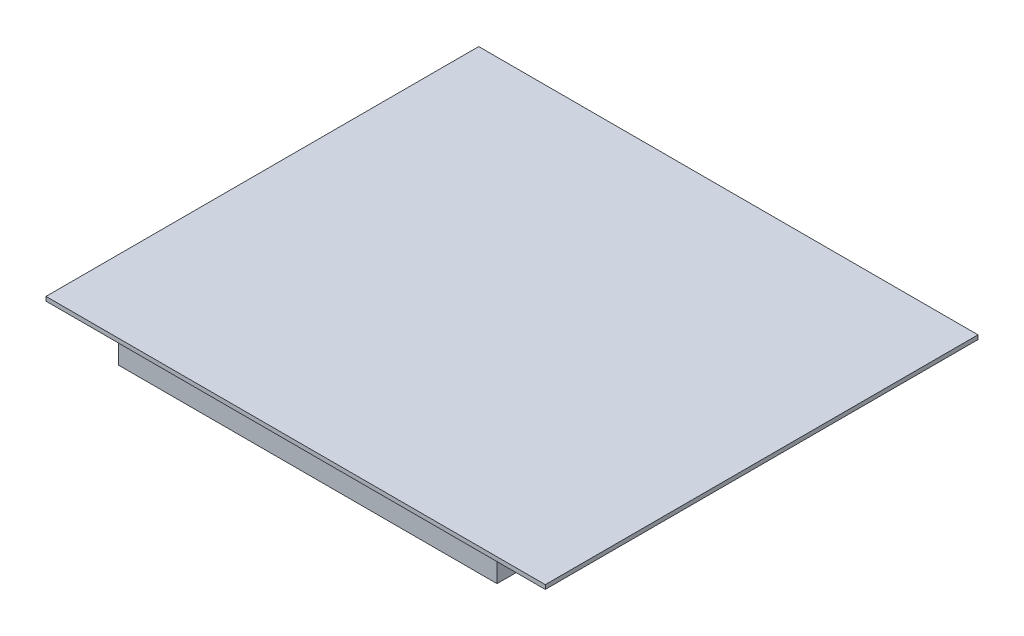
ISO-10303-21;
HEADER;
FILE_DESCRIPTION(('STEP AP214'),'2;1');
FILE_NAME('part.step','',(''),(''),'','','');
FILE_SCHEMA(('AUTOMOTIVE_DESIGN { 1 0 10303 214 1 1 1 1 }'));
ENDSEC;
DATA;
#1=APPLICATION_CONTEXT('core data for automotive mechanical design processes');
#2=APPLICATION_PROTOCOL_DEFINITION('international standard','automotive_design',2000,#1);
#3=PRODUCT_CONTEXT('',#1,'mechanical');
#4=PRODUCT('Part','Part','',(#3));
#5=PRODUCT_RELATED_PRODUCT_CATEGORY('part','',(#4));
#6=PRODUCT_DEFINITION_FORMATION('','',#4);
#7=PRODUCT_DEFINITION_CONTEXT('part definition',#1,'design');
#8=PRODUCT_DEFINITION('design','',#6,#7);
#9=PRODUCT_DEFINITION_SHAPE('','',#8);
#10=(LENGTH_UNIT() NAMED_UNIT(*) SI_UNIT(.MILLI.,.METRE.));
#11=(NAMED_UNIT(*) PLANE_ANGLE_UNIT() SI_UNIT($,.RADIAN.));
#12=(NAMED_UNIT(*) SI_UNIT($,.STERADIAN.) SOLID_ANGLE_UNIT());
#13=UNCERTAINTY_MEASURE_WITH_UNIT(LENGTH_MEASURE(1.E-05),#10,'distance_accuracy_value','');
#14=(GEOMETRIC_REPRESENTATION_CONTEXT(3) GLOBAL_UNCERTAINTY_ASSIGNED_CONTEXT((#13)) GLOBAL_UNIT_ASSIGNED_CONTEXT((#10,
#11,#12)) REPRESENTATION_CONTEXT('',''));
#15=CARTESIAN_POINT('',(0.,0.,0.));
#16=DIRECTION('',(0.,0.,1.));
#17=DIRECTION('',(1.,0.,0.));
#18=AXIS2_PLACEMENT_3D('',#15,#16,#17);
#19=CARTESIAN_POINT('',(0.,0.,0.));
#20=DIRECTION('',(0.,1.,0.));
#21=DIRECTION('',(0.,0.,1.));
#22=AXIS2_PLACEMENT_3D('',#19,#20,#21);
#23=PLANE('',#22);
#24=DIRECTION('',(0.,0.,1.));
#25=VECTOR('',#24,1.);
#26=CARTESIAN_POINT('',(-300.,0.,260.));
#27=LINE('',#26,#25);
#28=CARTESIAN_POINT('',(-300.,0.,-260.));
#29=VERTEX_POINT('',#28);
#30=CARTESIAN_POINT('',(-300.,0.,260.));
#31=VERTEX_POINT('',#30);
#32=EDGE_CURVE('E120',#29,#31,#27,.T.);
#33=ORIENTED_EDGE('',*,*,#32,.F.);
#34=DIRECTION('',(-1.,0.,0.));
#35=VECTOR('',#34,1.);
#36=CARTESIAN_POINT('',(300.,0.,-260.));
#37=LINE('',#36,#35);
#38=CARTESIAN_POINT('',(300.,0.,-260.));
#39=VERTEX_POINT('',#38);
#40=EDGE_CURVE('E133',#39,#29,#37,.T.);
#41=ORIENTED_EDGE('',*,*,#40,.F.);
#42=DIRECTION('',(0.,0.,-1.));
#43=VECTOR('',#42,1.);
#44=CARTESIAN_POINT('',(300.,0.,260.));
#45=LINE('',#44,#43);
#46=CARTESIAN_POINT('',(300.,0.,260.));
#47=VERTEX_POINT('',#46);
#48=EDGE_CURVE('E141',#47,#39,#45,.T.);
#49=ORIENTED_EDGE('',*,*,#48,.F.);
#50=DIRECTION('',(1.,0.,0.));
#51=VECTOR('',#50,1.);
#52=CARTESIAN_POINT('',(300.,0.,260.));
#53=LINE('',#52,#51);
#54=EDGE_CURVE('E123',#31,#47,#53,.T.);
#55=ORIENTED_EDGE('',*,*,#54,.F.);
#56=EDGE_LOOP('',(#33,#41,#49,#55));
#57=FACE_BOUND('',#56,.T.);
#58=DIRECTION('',(0.,0.,-1.));
#59=VECTOR('',#58,1.);
#60=CARTESIAN_POINT('',(-235.,0.,-248.));
#61=LINE('',#60,#59);
#62=CARTESIAN_POINT('',(-235.,0.,238.));
#63=VERTEX_POINT('',#62);
#64=CARTESIAN_POINT('',(-235.,0.,-248.));
#65=VERTEX_POINT('',#64);
#66=EDGE_CURVE('E50',#63,#65,#61,.T.);
#67=ORIENTED_EDGE('',*,*,#66,.F.);
#68=DIRECTION('',(-1.,0.,0.));
#69=VECTOR('',#68,1.);
#70=CARTESIAN_POINT('',(220.,0.,238.));
#71=LINE('',#70,#69);
#72=CARTESIAN_POINT('',(220.,0.,238.));
#73=VERTEX_POINT('',#72);
#74=EDGE_CURVE('E54',#73,#63,#71,.T.);
#75=ORIENTED_EDGE('',*,*,#74,.F.);
#76=DIRECTION('',(0.,0.,1.));
#77=VECTOR('',#76,1.);
#78=CARTESIAN_POINT('',(220.,0.,-248.));
#79=LINE('',#78,#77);
#80=CARTESIAN_POINT('',(220.,0.,-248.));
#81=VERTEX_POINT('',#80);
#82=EDGE_CURVE('E262',#81,#73,#79,.T.);
#83=ORIENTED_EDGE('',*,*,#82,.F.);
#84=DIRECTION('',(1.,0.,0.));
#85=VECTOR('',#84,1.);
#86=CARTESIAN_POINT('',(220.,0.,-248.));
#87=LINE('',#86,#85);
#88=EDGE_CURVE('E268',#65,#81,#87,.T.);
#89=ORIENTED_EDGE('',*,*,#88,.F.);
#90=EDGE_LOOP('',(#67,#75,#83,#89));
#91=FACE_BOUND('',#90,.T.);
#92=ADVANCED_FACE('F35',(#57,#91),#23,.F.);
#93=CARTESIAN_POINT('',(-300.,5.,260.));
#94=DIRECTION('',(1.,0.,0.));
#95=DIRECTION('',(0.,0.,-1.));
#96=AXIS2_PLACEMENT_3D('',#93,#94,#95);
#97=PLANE('',#96);
#98=ORIENTED_EDGE('',*,*,#32,.T.);
#99=DIRECTION('',(0.,-1.,0.));
#100=VECTOR('',#99,1.);
#101=CARTESIAN_POINT('',(-300.,5.,260.));
#102=LINE('',#101,#100);
#103=CARTESIAN_POINT('',(-300.,5.,260.));
#104=VERTEX_POINT('',#103);
#105=EDGE_CURVE('E11',#104,#31,#102,.T.);
#106=ORIENTED_EDGE('',*,*,#105,.F.);
#107=DIRECTION('',(0.,0.,1.));
#108=VECTOR('',#107,1.);
#109=CARTESIAN_POINT('',(-300.,5.,260.));
#110=LINE('',#109,#108);
#111=CARTESIAN_POINT('',(-300.,5.,-260.));
#112=VERTEX_POINT('',#111);
#113=EDGE_CURVE('E129',#112,#104,#110,.T.);
#114=ORIENTED_EDGE('',*,*,#113,.F.);
#115=DIRECTION('',(0.,-1.,0.));
#116=VECTOR('',#115,1.);
#117=CARTESIAN_POINT('',(-300.,5.,-260.));
#118=LINE('',#117,#116);
#119=EDGE_CURVE('E138',#112,#29,#118,.T.);
#120=ORIENTED_EDGE('',*,*,#119,.T.);
#121=EDGE_LOOP('',(#98,#106,#114,#120));
#122=FACE_BOUND('',#121,.T.);
#123=ADVANCED_FACE('F37',(#122),#97,.F.);
#124=CARTESIAN_POINT('',(300.,5.,260.));
#125=DIRECTION('',(0.,0.,-1.));
#126=DIRECTION('',(-1.,0.,0.));
#127=AXIS2_PLACEMENT_3D('',#124,#125,#126);
#128=PLANE('',#127);
#129=ORIENTED_EDGE('',*,*,#54,.T.);
#130=DIRECTION('',(0.,-1.,0.));
#131=VECTOR('',#130,1.);
#132=CARTESIAN_POINT('',(300.,5.,260.));
#133=LINE('',#132,#131);
#134=CARTESIAN_POINT('',(300.,5.,260.));
#135=VERTEX_POINT('',#134);
#136=EDGE_CURVE('E43',#135,#47,#133,.T.);
#137=ORIENTED_EDGE('',*,*,#136,.F.);
#138=DIRECTION('',(1.,0.,0.));
#139=VECTOR('',#138,1.);
#140=CARTESIAN_POINT('',(300.,5.,260.));
#141=LINE('',#140,#139);
#142=EDGE_CURVE('E132',#104,#135,#141,.T.);
#143=ORIENTED_EDGE('',*,*,#142,.F.);
#144=ORIENTED_EDGE('',*,*,#105,.T.);
#145=EDGE_LOOP('',(#129,#137,#143,#144));
#146=FACE_BOUND('',#145,.T.);
#147=ADVANCED_FACE('F168',(#146),#128,.F.);
#148=CARTESIAN_POINT('',(300.,5.,260.));
#149=DIRECTION('',(-1.,0.,0.));
#150=DIRECTION('',(0.,0.,1.));
#151=AXIS2_PLACEMENT_3D('',#148,#149,#150);
#152=PLANE('',#151);
#153=ORIENTED_EDGE('',*,*,#48,.T.);
#154=DIRECTION('',(0.,-1.,0.));
#155=VECTOR('',#154,1.);
#156=CARTESIAN_POINT('',(300.,5.,-260.));
#157=LINE('',#156,#155);
#158=CARTESIAN_POINT('',(300.,5.,-260.));
#159=VERTEX_POINT('',#158);
#160=EDGE_CURVE('E146',#159,#39,#157,.T.);
#161=ORIENTED_EDGE('',*,*,#160,.F.);
#162=DIRECTION('',(0.,0.,-1.));
#163=VECTOR('',#162,1.);
#164=CARTESIAN_POINT('',(300.,5.,260.));
#165=LINE('',#164,#163);
#166=EDGE_CURVE('E135',#135,#159,#165,.T.);
#167=ORIENTED_EDGE('',*,*,#166,.F.);
#168=ORIENTED_EDGE('',*,*,#136,.T.);
#169=EDGE_LOOP('',(#153,#161,#167,#168));
#170=FACE_BOUND('',#169,.T.);
#171=ADVANCED_FACE('F153',(#170),#152,.F.);
#172=CARTESIAN_POINT('',(300.,5.,-260.));
#173=DIRECTION('',(0.,0.,1.));
#174=DIRECTION('',(1.,0.,0.));
#175=AXIS2_PLACEMENT_3D('',#172,#173,#174);
#176=PLANE('',#175);
#177=ORIENTED_EDGE('',*,*,#40,.T.);
#178=ORIENTED_EDGE('',*,*,#119,.F.);
#179=DIRECTION('',(-1.,0.,0.));
#180=VECTOR('',#179,1.);
#181=CARTESIAN_POINT('',(300.,5.,-260.));
#182=LINE('',#181,#180);
#183=EDGE_CURVE('E137',#159,#112,#182,.T.);
#184=ORIENTED_EDGE('',*,*,#183,.F.);
#185=ORIENTED_EDGE('',*,*,#160,.T.);
#186=EDGE_LOOP('',(#177,#178,#184,#185));
#187=FACE_BOUND('',#186,.T.);
#188=ADVANCED_FACE('F161',(#187),#176,.F.);
#189=CARTESIAN_POINT('',(0.,5.,0.));
#190=DIRECTION('',(0.,1.,0.));
#191=DIRECTION('',(0.,0.,1.));
#192=AXIS2_PLACEMENT_3D('',#189,#190,#191);
#193=PLANE('',#192);
#194=ORIENTED_EDGE('',*,*,#113,.T.);
#195=ORIENTED_EDGE('',*,*,#142,.T.);
#196=ORIENTED_EDGE('',*,*,#166,.T.);
#197=ORIENTED_EDGE('',*,*,#183,.T.);
#198=EDGE_LOOP('',(#194,#195,#196,#197));
#199=FACE_BOUND('',#198,.T.);
#200=ADVANCED_FACE('F167',(#199),#193,.T.);
#201=CARTESIAN_POINT('',(-235.,-45.,-248.));
#202=DIRECTION('',(1.,0.,0.));
#203=DIRECTION('',(0.,0.,-1.));
#204=AXIS2_PLACEMENT_3D('',#201,#202,#203);
#205=PLANE('',#204);
#206=ORIENTED_EDGE('',*,*,#66,.T.);
#207=DIRECTION('',(0.,1.,0.));
#208=VECTOR('',#207,1.);
#209=CARTESIAN_POINT('',(-235.,-45.,-248.));
#210=LINE('',#209,#208);
#211=CARTESIAN_POINT('',(-235.,-45.,-248.));
#212=VERTEX_POINT('',#211);
#213=EDGE_CURVE('E103',#212,#65,#210,.T.);
#214=ORIENTED_EDGE('',*,*,#213,.F.);
#215=DIRECTION('',(0.,0.,-1.));
#216=VECTOR('',#215,1.);
#217=CARTESIAN_POINT('',(-235.,-45.,-248.));
#218=LINE('',#217,#216);
#219=CARTESIAN_POINT('',(-235.,-45.,238.));
#220=VERTEX_POINT('',#219);
#221=EDGE_CURVE('E109',#220,#212,#218,.T.);
#222=ORIENTED_EDGE('',*,*,#221,.F.);
#223=DIRECTION('',(0.,1.,0.));
#224=VECTOR('',#223,1.);
#225=CARTESIAN_POINT('',(-235.,-45.,238.));
#226=LINE('',#225,#224);
#227=EDGE_CURVE('E260',#220,#63,#226,.T.);
#228=ORIENTED_EDGE('',*,*,#227,.T.);
#229=EDGE_LOOP('',(#206,#214,#222,#228));
#230=FACE_BOUND('',#229,.T.);
#231=ADVANCED_FACE('F119',(#230),#205,.F.);
#232=CARTESIAN_POINT('',(220.,-45.,-248.));
#233=DIRECTION('',(0.,0.,1.));
#234=DIRECTION('',(1.,0.,0.));
#235=AXIS2_PLACEMENT_3D('',#232,#233,#234);
#236=PLANE('',#235);
#237=ORIENTED_EDGE('',*,*,#88,.T.);
#238=DIRECTION('',(0.,1.,0.));
#239=VECTOR('',#238,1.);
#240=CARTESIAN_POINT('',(220.,-45.,-248.));
#241=LINE('',#240,#239);
#242=CARTESIAN_POINT('',(220.,-45.,-248.));
#243=VERTEX_POINT('',#242);
#244=EDGE_CURVE('E105',#243,#81,#241,.T.);
#245=ORIENTED_EDGE('',*,*,#244,.F.);
#246=DIRECTION('',(1.,0.,0.));
#247=VECTOR('',#246,1.);
#248=CARTESIAN_POINT('',(220.,-45.,-248.));
#249=LINE('',#248,#247);
#250=EDGE_CURVE('E98',#212,#243,#249,.T.);
#251=ORIENTED_EDGE('',*,*,#250,.F.);
#252=ORIENTED_EDGE('',*,*,#213,.T.);
#253=EDGE_LOOP('',(#237,#245,#251,#252));
#254=FACE_BOUND('',#253,.T.);
#255=ADVANCED_FACE('F101',(#254),#236,.F.);
#256=CARTESIAN_POINT('',(220.,-45.,-248.));
#257=DIRECTION('',(-1.,0.,0.));
#258=DIRECTION('',(0.,0.,1.));
#259=AXIS2_PLACEMENT_3D('',#256,#257,#258);
#260=PLANE('',#259);
#261=ORIENTED_EDGE('',*,*,#82,.T.);
#262=DIRECTION('',(0.,1.,0.));
#263=VECTOR('',#262,1.);
#264=CARTESIAN_POINT('',(220.,-45.,238.));
#265=LINE('',#264,#263);
#266=CARTESIAN_POINT('',(220.,-45.,238.));
#267=VERTEX_POINT('',#266);
#268=EDGE_CURVE('E125',#267,#73,#265,.T.);
#269=ORIENTED_EDGE('',*,*,#268,.F.);
#270=DIRECTION('',(0.,0.,1.));
#271=VECTOR('',#270,1.);
#272=CARTESIAN_POINT('',(220.,-45.,-248.));
#273=LINE('',#272,#271);
#274=EDGE_CURVE('E108',#243,#267,#273,.T.);
#275=ORIENTED_EDGE('',*,*,#274,.F.);
#276=ORIENTED_EDGE('',*,*,#244,.T.);
#277=EDGE_LOOP('',(#261,#269,#275,#276));
#278=FACE_BOUND('',#277,.T.);
#279=ADVANCED_FACE('F192',(#278),#260,.F.);
#280=CARTESIAN_POINT('',(220.,-45.,238.));
#281=DIRECTION('',(0.,0.,-1.));
#282=DIRECTION('',(-1.,0.,0.));
#283=AXIS2_PLACEMENT_3D('',#280,#281,#282);
#284=PLANE('',#283);
#285=ORIENTED_EDGE('',*,*,#74,.T.);
#286=ORIENTED_EDGE('',*,*,#227,.F.);
#287=DIRECTION('',(-1.,0.,0.));
#288=VECTOR('',#287,1.);
#289=CARTESIAN_POINT('',(220.,-45.,238.));
#290=LINE('',#289,#288);
#291=EDGE_CURVE('E114',#267,#220,#290,.T.);
#292=ORIENTED_EDGE('',*,*,#291,.F.);
#293=ORIENTED_EDGE('',*,*,#268,.T.);
#294=EDGE_LOOP('',(#285,#286,#292,#293));
#295=FACE_BOUND('',#294,.T.);
#296=ADVANCED_FACE('F197',(#295),#284,.F.);
#297=CARTESIAN_POINT('',(0.,-45.,0.));
#298=DIRECTION('',(0.,-1.,0.));
#299=DIRECTION('',(0.,0.,-1.));
#300=AXIS2_PLACEMENT_3D('',#297,#298,#299);
#301=PLANE('',#300);
#302=ORIENTED_EDGE('',*,*,#221,.T.);
#303=ORIENTED_EDGE('',*,*,#250,.T.);
#304=ORIENTED_EDGE('',*,*,#274,.T.);
#305=ORIENTED_EDGE('',*,*,#291,.T.);
#306=EDGE_LOOP('',(#302,#303,#304,#305));
#307=FACE_BOUND('',#306,.T.);
#308=ADVANCED_FACE('F112',(#307),#301,.T.);
#309=CLOSED_SHELL('',(#92,#123,#147,#171,#188,#200,#231,#255,#279,#296,#308));
#310=MANIFOLD_SOLID_BREP('B2',#309);
#311=ADVANCED_BREP_SHAPE_REPRESENTATION('',(#18,#310),#14);
#312=SHAPE_DEFINITION_REPRESENTATION(#9,#311);
ENDSEC;
END-ISO-10303-21;
